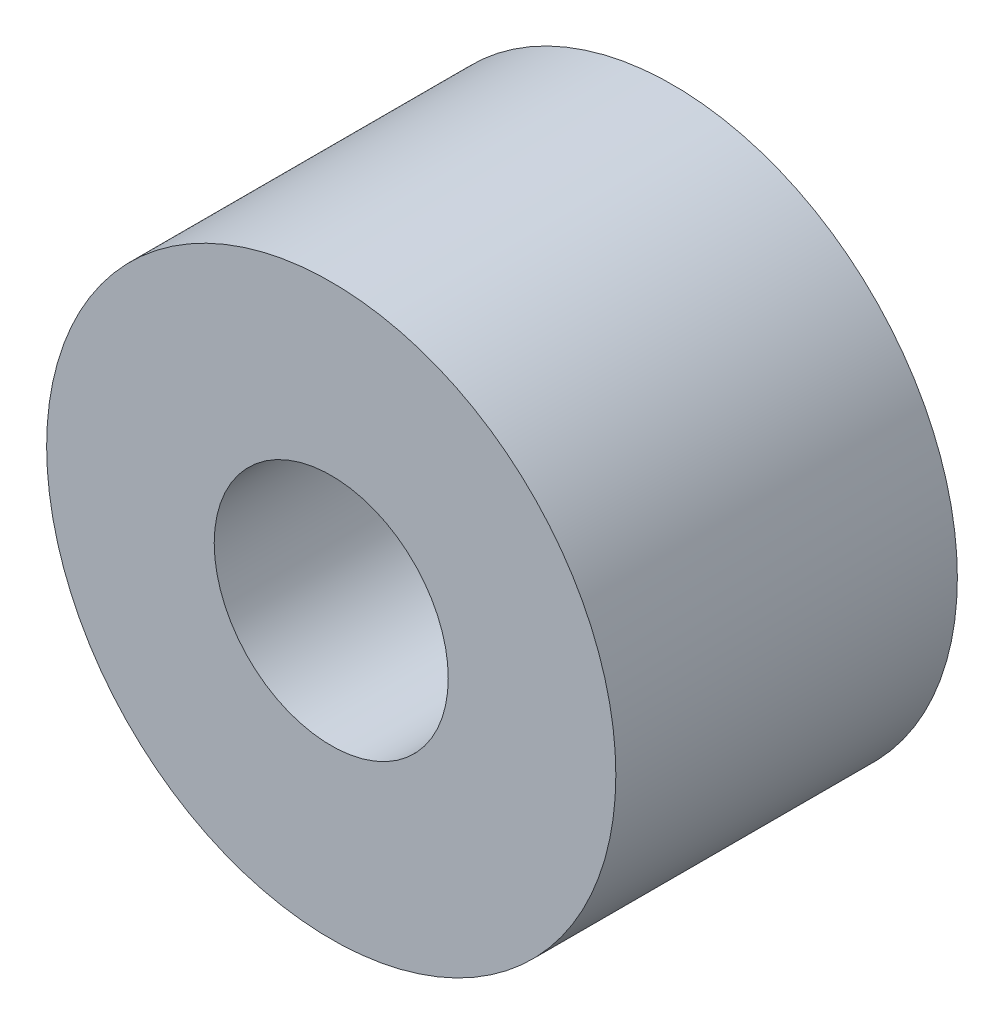
ISO-10303-21;
HEADER;
FILE_DESCRIPTION(('STEP AP214'),'2;1');
FILE_NAME('part.step','',(''),(''),'','','');
FILE_SCHEMA(('AUTOMOTIVE_DESIGN { 1 0 10303 214 1 1 1 1 }'));
ENDSEC;
DATA;
#1=APPLICATION_CONTEXT('core data for automotive mechanical design processes');
#2=APPLICATION_PROTOCOL_DEFINITION('international standard','automotive_design',2000,#1);
#3=PRODUCT_CONTEXT('',#1,'mechanical');
#4=PRODUCT('Part','Part','',(#3));
#5=PRODUCT_RELATED_PRODUCT_CATEGORY('part','',(#4));
#6=PRODUCT_DEFINITION_FORMATION('','',#4);
#7=PRODUCT_DEFINITION_CONTEXT('part definition',#1,'design');
#8=PRODUCT_DEFINITION('design','',#6,#7);
#9=PRODUCT_DEFINITION_SHAPE('','',#8);
#10=(LENGTH_UNIT() NAMED_UNIT(*) SI_UNIT(.MILLI.,.METRE.));
#11=(NAMED_UNIT(*) PLANE_ANGLE_UNIT() SI_UNIT($,.RADIAN.));
#12=(NAMED_UNIT(*) SI_UNIT($,.STERADIAN.) SOLID_ANGLE_UNIT());
#13=UNCERTAINTY_MEASURE_WITH_UNIT(LENGTH_MEASURE(1.E-05),#10,'distance_accuracy_value','');
#14=(GEOMETRIC_REPRESENTATION_CONTEXT(3) GLOBAL_UNCERTAINTY_ASSIGNED_CONTEXT((#13)) GLOBAL_UNIT_ASSIGNED_CONTEXT((#10,
#11,#12)) REPRESENTATION_CONTEXT('',''));
#15=CARTESIAN_POINT('',(0.,0.,0.));
#16=DIRECTION('',(0.,0.,1.));
#17=DIRECTION('',(1.,0.,0.));
#18=AXIS2_PLACEMENT_3D('',#15,#16,#17);
#19=CARTESIAN_POINT('',(0.,0.,9.525));
#20=DIRECTION('',(0.,0.,-1.));
#21=DIRECTION('',(-1.,0.,0.));
#22=AXIS2_PLACEMENT_3D('',#19,#20,#21);
#23=CYLINDRICAL_SURFACE('',#22,7.9375);
#24=CARTESIAN_POINT('',(0.,0.,9.525));
#25=DIRECTION('',(0.,0.,1.));
#26=DIRECTION('',(1.,0.,0.));
#27=AXIS2_PLACEMENT_3D('',#24,#25,#26);
#28=CIRCLE('',#27,7.9375);
#29=CARTESIAN_POINT('',(7.9375,0.,9.525));
#30=VERTEX_POINT('',#29);
#31=EDGE_CURVE('E10',#30,#30,#28,.T.);
#32=ORIENTED_EDGE('',*,*,#31,.F.);
#33=EDGE_LOOP('',(#32));
#34=FACE_BOUND('',#33,.T.);
#35=CARTESIAN_POINT('',(0.,0.,0.));
#36=DIRECTION('',(0.,0.,1.));
#37=DIRECTION('',(1.,0.,0.));
#38=AXIS2_PLACEMENT_3D('',#35,#36,#37);
#39=CIRCLE('',#38,7.9375);
#40=CARTESIAN_POINT('',(7.9375,0.,0.));
#41=VERTEX_POINT('',#40);
#42=EDGE_CURVE('E34',#41,#41,#39,.T.);
#43=ORIENTED_EDGE('',*,*,#42,.T.);
#44=EDGE_LOOP('',(#43));
#45=FACE_BOUND('',#44,.T.);
#46=ADVANCED_FACE('F31',(#34,#45),#23,.T.);
#47=CARTESIAN_POINT('',(0.,0.,9.525));
#48=DIRECTION('',(0.,0.,1.));
#49=DIRECTION('',(1.,0.,0.));
#50=AXIS2_PLACEMENT_3D('',#47,#48,#49);
#51=PLANE('',#50);
#52=CARTESIAN_POINT('',(0.,0.,9.525));
#53=DIRECTION('',(0.,0.,1.));
#54=DIRECTION('',(1.,0.,0.));
#55=AXIS2_PLACEMENT_3D('',#52,#53,#54);
#56=CIRCLE('',#55,3.2639);
#57=CARTESIAN_POINT('',(3.2639,0.,9.525));
#58=VERTEX_POINT('',#57);
#59=EDGE_CURVE('E45',#58,#58,#56,.T.);
#60=ORIENTED_EDGE('',*,*,#59,.F.);
#61=EDGE_LOOP('',(#60));
#62=FACE_BOUND('',#61,.T.);
#63=ORIENTED_EDGE('',*,*,#31,.T.);
#64=EDGE_LOOP('',(#63));
#65=FACE_BOUND('',#64,.T.);
#66=ADVANCED_FACE('F51',(#62,#65),#51,.T.);
#67=CARTESIAN_POINT('',(0.,0.,0.));
#68=DIRECTION('',(0.,0.,1.));
#69=DIRECTION('',(1.,0.,0.));
#70=AXIS2_PLACEMENT_3D('',#67,#68,#69);
#71=PLANE('',#70);
#72=CARTESIAN_POINT('',(0.,0.,0.));
#73=DIRECTION('',(0.,0.,1.));
#74=DIRECTION('',(1.,0.,0.));
#75=AXIS2_PLACEMENT_3D('',#72,#73,#74);
#76=CIRCLE('',#75,3.2639);
#77=CARTESIAN_POINT('',(3.2639,0.,0.));
#78=VERTEX_POINT('',#77);
#79=EDGE_CURVE('E41',#78,#78,#76,.T.);
#80=ORIENTED_EDGE('',*,*,#79,.T.);
#81=EDGE_LOOP('',(#80));
#82=FACE_BOUND('',#81,.T.);
#83=ORIENTED_EDGE('',*,*,#42,.F.);
#84=EDGE_LOOP('',(#83));
#85=FACE_BOUND('',#84,.T.);
#86=ADVANCED_FACE('F53',(#82,#85),#71,.F.);
#87=CARTESIAN_POINT('',(0.,0.,9.525));
#88=DIRECTION('',(0.,0.,1.));
#89=DIRECTION('',(1.,0.,0.));
#90=AXIS2_PLACEMENT_3D('',#87,#88,#89);
#91=CYLINDRICAL_SURFACE('',#90,3.2639);
#92=ORIENTED_EDGE('',*,*,#79,.F.);
#93=EDGE_LOOP('',(#92));
#94=FACE_BOUND('',#93,.T.);
#95=ORIENTED_EDGE('',*,*,#59,.T.);
#96=EDGE_LOOP('',(#95));
#97=FACE_BOUND('',#96,.T.);
#98=ADVANCED_FACE('F49',(#94,#97),#91,.F.);
#99=CLOSED_SHELL('',(#46,#66,#86,#98));
#100=MANIFOLD_SOLID_BREP('B2',#99);
#101=ADVANCED_BREP_SHAPE_REPRESENTATION('',(#18,#100),#14);
#102=SHAPE_DEFINITION_REPRESENTATION(#9,#101);
ENDSEC;
END-ISO-10303-21;
